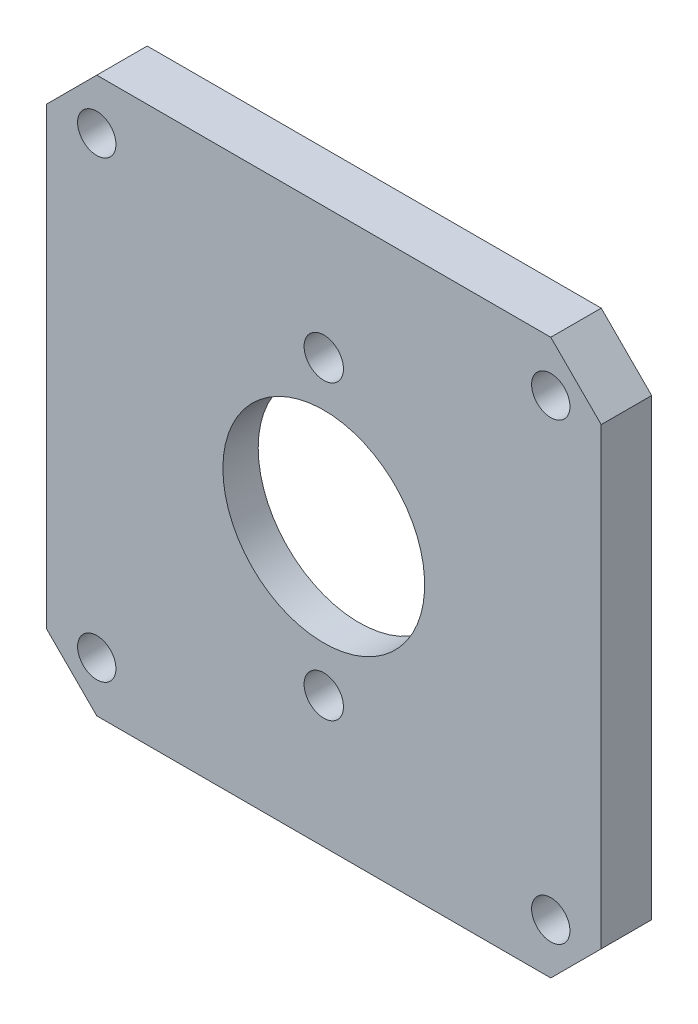
ISO-10303-21;
HEADER;
FILE_DESCRIPTION(('STEP AP214'),'2;1');
FILE_NAME('part.step','',(''),(''),'','','');
FILE_SCHEMA(('AUTOMOTIVE_DESIGN { 1 0 10303 214 1 1 1 1 }'));
ENDSEC;
DATA;
#1=APPLICATION_CONTEXT('core data for automotive mechanical design processes');
#2=APPLICATION_PROTOCOL_DEFINITION('international standard','automotive_design',2000,#1);
#3=PRODUCT_CONTEXT('',#1,'mechanical');
#4=PRODUCT('Part','Part','',(#3));
#5=PRODUCT_RELATED_PRODUCT_CATEGORY('part','',(#4));
#6=PRODUCT_DEFINITION_FORMATION('','',#4);
#7=PRODUCT_DEFINITION_CONTEXT('part definition',#1,'design');
#8=PRODUCT_DEFINITION('design','',#6,#7);
#9=PRODUCT_DEFINITION_SHAPE('','',#8);
#10=(LENGTH_UNIT() NAMED_UNIT(*) SI_UNIT(.MILLI.,.METRE.));
#11=(NAMED_UNIT(*) PLANE_ANGLE_UNIT() SI_UNIT($,.RADIAN.));
#12=(NAMED_UNIT(*) SI_UNIT($,.STERADIAN.) SOLID_ANGLE_UNIT());
#13=UNCERTAINTY_MEASURE_WITH_UNIT(LENGTH_MEASURE(1.E-05),#10,'distance_accuracy_value','');
#14=(GEOMETRIC_REPRESENTATION_CONTEXT(3) GLOBAL_UNCERTAINTY_ASSIGNED_CONTEXT((#13)) GLOBAL_UNIT_ASSIGNED_CONTEXT((#10,
#11,#12)) REPRESENTATION_CONTEXT('',''));
#15=CARTESIAN_POINT('',(0.,0.,0.));
#16=DIRECTION('',(0.,0.,1.));
#17=DIRECTION('',(1.,0.,0.));
#18=AXIS2_PLACEMENT_3D('',#15,#16,#17);
#19=CARTESIAN_POINT('',(0.,14.5,10.));
#20=DIRECTION('',(0.,0.,-1.));
#21=DIRECTION('',(-1.,0.,0.));
#22=AXIS2_PLACEMENT_3D('',#19,#20,#21);
#23=CYLINDRICAL_SURFACE('',#22,1.95);
#24=CARTESIAN_POINT('',(0.,14.5,5.));
#25=DIRECTION('',(0.,0.,-1.));
#26=DIRECTION('',(-1.,0.,0.));
#27=AXIS2_PLACEMENT_3D('',#24,#25,#26);
#28=CIRCLE('',#27,1.95);
#29=CARTESIAN_POINT('',(-1.95,14.5,5.));
#30=VERTEX_POINT('',#29);
#31=EDGE_CURVE('E389',#30,#30,#28,.T.);
#32=ORIENTED_EDGE('',*,*,#31,.F.);
#33=EDGE_LOOP('',(#32));
#34=FACE_BOUND('',#33,.T.);
#35=CARTESIAN_POINT('',(0.,14.5,1.5));
#36=DIRECTION('',(0.,0.,-1.));
#37=DIRECTION('',(-1.,0.,0.));
#38=AXIS2_PLACEMENT_3D('',#35,#36,#37);
#39=CIRCLE('',#38,1.95);
#40=CARTESIAN_POINT('',(-1.95,14.5,1.5));
#41=VERTEX_POINT('',#40);
#42=EDGE_CURVE('E376',#41,#41,#39,.F.);
#43=ORIENTED_EDGE('',*,*,#42,.F.);
#44=EDGE_LOOP('',(#43));
#45=FACE_BOUND('',#44,.T.);
#46=ADVANCED_FACE('F46',(#34,#45),#23,.F.);
#47=CARTESIAN_POINT('',(0.,0.,10.));
#48=DIRECTION('',(0.,0.,-1.));
#49=DIRECTION('',(-1.,0.,0.));
#50=AXIS2_PLACEMENT_3D('',#47,#48,#49);
#51=CYLINDRICAL_SURFACE('',#50,10.);
#52=CARTESIAN_POINT('',(0.,0.,5.));
#53=DIRECTION('',(0.,0.,-1.));
#54=DIRECTION('',(-1.,0.,0.));
#55=AXIS2_PLACEMENT_3D('',#52,#53,#54);
#56=CIRCLE('',#55,10.);
#57=CARTESIAN_POINT('',(-10.,0.,5.));
#58=VERTEX_POINT('',#57);
#59=EDGE_CURVE('E400',#58,#58,#56,.T.);
#60=ORIENTED_EDGE('',*,*,#59,.F.);
#61=EDGE_LOOP('',(#60));
#62=FACE_BOUND('',#61,.T.);
#63=CARTESIAN_POINT('',(0.,0.,1.5));
#64=DIRECTION('',(0.,0.,-1.));
#65=DIRECTION('',(-1.,0.,0.));
#66=AXIS2_PLACEMENT_3D('',#63,#64,#65);
#67=CIRCLE('',#66,10.);
#68=CARTESIAN_POINT('',(-10.,0.,1.5));
#69=VERTEX_POINT('',#68);
#70=EDGE_CURVE('E372',#69,#69,#67,.F.);
#71=ORIENTED_EDGE('',*,*,#70,.F.);
#72=EDGE_LOOP('',(#71));
#73=FACE_BOUND('',#72,.T.);
#74=ADVANCED_FACE('F222',(#62,#73),#51,.F.);
#75=CARTESIAN_POINT('',(0.,-14.5,10.));
#76=DIRECTION('',(0.,0.,-1.));
#77=DIRECTION('',(-1.,0.,0.));
#78=AXIS2_PLACEMENT_3D('',#75,#76,#77);
#79=CYLINDRICAL_SURFACE('',#78,1.95);
#80=CARTESIAN_POINT('',(0.,-14.5,5.));
#81=DIRECTION('',(0.,0.,-1.));
#82=DIRECTION('',(-1.,0.,0.));
#83=AXIS2_PLACEMENT_3D('',#80,#81,#82);
#84=CIRCLE('',#83,1.95);
#85=CARTESIAN_POINT('',(-1.95,-14.5,5.));
#86=VERTEX_POINT('',#85);
#87=EDGE_CURVE('E416',#86,#86,#84,.T.);
#88=ORIENTED_EDGE('',*,*,#87,.F.);
#89=EDGE_LOOP('',(#88));
#90=FACE_BOUND('',#89,.T.);
#91=CARTESIAN_POINT('',(0.,-14.5,1.5));
#92=DIRECTION('',(0.,0.,-1.));
#93=DIRECTION('',(-1.,0.,0.));
#94=AXIS2_PLACEMENT_3D('',#91,#92,#93);
#95=CIRCLE('',#94,1.95);
#96=CARTESIAN_POINT('',(-1.95,-14.5,1.5));
#97=VERTEX_POINT('',#96);
#98=EDGE_CURVE('E51',#97,#97,#95,.F.);
#99=ORIENTED_EDGE('',*,*,#98,.F.);
#100=EDGE_LOOP('',(#99));
#101=FACE_BOUND('',#100,.T.);
#102=ADVANCED_FACE('F214',(#90,#101),#79,.F.);
#103=CARTESIAN_POINT('',(-27.5,-27.5,5.));
#104=DIRECTION('',(-1.,0.,0.));
#105=DIRECTION('',(0.,0.,1.));
#106=AXIS2_PLACEMENT_3D('',#103,#104,#105);
#107=PLANE('',#106);
#108=DIRECTION('',(0.,1.,0.));
#109=VECTOR('',#108,1.);
#110=CARTESIAN_POINT('',(-27.5,-27.5,0.));
#111=LINE('',#110,#109);
#112=CARTESIAN_POINT('',(-27.5,-22.5,0.));
#113=VERTEX_POINT('',#112);
#114=CARTESIAN_POINT('',(-27.5,22.5,0.));
#115=VERTEX_POINT('',#114);
#116=EDGE_CURVE('E200',#113,#115,#111,.T.);
#117=ORIENTED_EDGE('',*,*,#116,.F.);
#118=DIRECTION('',(0.,0.,1.));
#119=VECTOR('',#118,1.);
#120=CARTESIAN_POINT('',(-27.5,-22.5,5.));
#121=LINE('',#120,#119);
#122=CARTESIAN_POINT('',(-27.5,-22.5,5.));
#123=VERTEX_POINT('',#122);
#124=EDGE_CURVE('E120',#113,#123,#121,.T.);
#125=ORIENTED_EDGE('',*,*,#124,.T.);
#126=DIRECTION('',(0.,1.,0.));
#127=VECTOR('',#126,1.);
#128=CARTESIAN_POINT('',(-27.5,-27.5,5.));
#129=LINE('',#128,#127);
#130=CARTESIAN_POINT('',(-27.5,22.5,5.));
#131=VERTEX_POINT('',#130);
#132=EDGE_CURVE('E144',#123,#131,#129,.T.);
#133=ORIENTED_EDGE('',*,*,#132,.T.);
#134=DIRECTION('',(0.,0.,-1.));
#135=VECTOR('',#134,1.);
#136=CARTESIAN_POINT('',(-27.5,22.5,5.));
#137=LINE('',#136,#135);
#138=EDGE_CURVE('E126',#131,#115,#137,.T.);
#139=ORIENTED_EDGE('',*,*,#138,.T.);
#140=EDGE_LOOP('',(#117,#125,#133,#139));
#141=FACE_BOUND('',#140,.T.);
#142=ADVANCED_FACE('F212',(#141),#107,.T.);
#143=CARTESIAN_POINT('',(-27.5,-27.5,5.));
#144=DIRECTION('',(0.,1.,0.));
#145=DIRECTION('',(0.,0.,1.));
#146=AXIS2_PLACEMENT_3D('',#143,#144,#145);
#147=PLANE('',#146);
#148=DIRECTION('',(1.,0.,0.));
#149=VECTOR('',#148,1.);
#150=CARTESIAN_POINT('',(-27.5,-27.5,5.));
#151=LINE('',#150,#149);
#152=CARTESIAN_POINT('',(-22.5,-27.5,5.));
#153=VERTEX_POINT('',#152);
#154=CARTESIAN_POINT('',(22.5,-27.5,5.));
#155=VERTEX_POINT('',#154);
#156=EDGE_CURVE('E136',#153,#155,#151,.T.);
#157=ORIENTED_EDGE('',*,*,#156,.F.);
#158=DIRECTION('',(0.,0.,-1.));
#159=VECTOR('',#158,1.);
#160=CARTESIAN_POINT('',(-22.5,-27.5,0.));
#161=LINE('',#160,#159);
#162=CARTESIAN_POINT('',(-22.5,-27.5,0.));
#163=VERTEX_POINT('',#162);
#164=EDGE_CURVE('E119',#153,#163,#161,.T.);
#165=ORIENTED_EDGE('',*,*,#164,.T.);
#166=DIRECTION('',(1.,0.,0.));
#167=VECTOR('',#166,1.);
#168=CARTESIAN_POINT('',(-27.5,-27.5,0.));
#169=LINE('',#168,#167);
#170=CARTESIAN_POINT('',(22.5,-27.5,0.));
#171=VERTEX_POINT('',#170);
#172=EDGE_CURVE('E133',#163,#171,#169,.T.);
#173=ORIENTED_EDGE('',*,*,#172,.T.);
#174=DIRECTION('',(0.,0.,1.));
#175=VECTOR('',#174,1.);
#176=CARTESIAN_POINT('',(22.5,-27.5,5.));
#177=LINE('',#176,#175);
#178=EDGE_CURVE('E139',#171,#155,#177,.T.);
#179=ORIENTED_EDGE('',*,*,#178,.T.);
#180=EDGE_LOOP('',(#157,#165,#173,#179));
#181=FACE_BOUND('',#180,.T.);
#182=ADVANCED_FACE('F132',(#181),#147,.F.);
#183=CARTESIAN_POINT('',(27.5,-27.5,5.));
#184=DIRECTION('',(-1.,0.,0.));
#185=DIRECTION('',(0.,0.,1.));
#186=AXIS2_PLACEMENT_3D('',#183,#184,#185);
#187=PLANE('',#186);
#188=DIRECTION('',(0.,1.,0.));
#189=VECTOR('',#188,1.);
#190=CARTESIAN_POINT('',(27.5,-27.5,5.));
#191=LINE('',#190,#189);
#192=CARTESIAN_POINT('',(27.5,-22.5,5.));
#193=VERTEX_POINT('',#192);
#194=CARTESIAN_POINT('',(27.5,22.5,5.));
#195=VERTEX_POINT('',#194);
#196=EDGE_CURVE('E192',#193,#195,#191,.T.);
#197=ORIENTED_EDGE('',*,*,#196,.F.);
#198=DIRECTION('',(0.,0.,-1.));
#199=VECTOR('',#198,1.);
#200=CARTESIAN_POINT('',(27.5,-22.5,5.));
#201=LINE('',#200,#199);
#202=CARTESIAN_POINT('',(27.5,-22.5,0.));
#203=VERTEX_POINT('',#202);
#204=EDGE_CURVE('E185',#193,#203,#201,.T.);
#205=ORIENTED_EDGE('',*,*,#204,.T.);
#206=DIRECTION('',(0.,1.,0.));
#207=VECTOR('',#206,1.);
#208=CARTESIAN_POINT('',(27.5,-27.5,0.));
#209=LINE('',#208,#207);
#210=CARTESIAN_POINT('',(27.5,22.5,0.));
#211=VERTEX_POINT('',#210);
#212=EDGE_CURVE('E145',#203,#211,#209,.T.);
#213=ORIENTED_EDGE('',*,*,#212,.T.);
#214=DIRECTION('',(0.,0.,1.));
#215=VECTOR('',#214,1.);
#216=CARTESIAN_POINT('',(27.5,22.5,5.));
#217=LINE('',#216,#215);
#218=EDGE_CURVE('E182',#211,#195,#217,.T.);
#219=ORIENTED_EDGE('',*,*,#218,.T.);
#220=EDGE_LOOP('',(#197,#205,#213,#219));
#221=FACE_BOUND('',#220,.T.);
#222=ADVANCED_FACE('F219',(#221),#187,.F.);
#223=CARTESIAN_POINT('',(-27.5,27.5,5.));
#224=DIRECTION('',(0.,1.,0.));
#225=DIRECTION('',(0.,0.,1.));
#226=AXIS2_PLACEMENT_3D('',#223,#224,#225);
#227=PLANE('',#226);
#228=DIRECTION('',(1.,0.,0.));
#229=VECTOR('',#228,1.);
#230=CARTESIAN_POINT('',(-27.5,27.5,5.));
#231=LINE('',#230,#229);
#232=CARTESIAN_POINT('',(-22.5,27.5,5.));
#233=VERTEX_POINT('',#232);
#234=CARTESIAN_POINT('',(22.5,27.5,5.));
#235=VERTEX_POINT('',#234);
#236=EDGE_CURVE('E150',#233,#235,#231,.T.);
#237=ORIENTED_EDGE('',*,*,#236,.T.);
#238=DIRECTION('',(0.,0.,-1.));
#239=VECTOR('',#238,1.);
#240=CARTESIAN_POINT('',(22.5,27.5,0.));
#241=LINE('',#240,#239);
#242=CARTESIAN_POINT('',(22.5,27.5,0.));
#243=VERTEX_POINT('',#242);
#244=EDGE_CURVE('E11',#235,#243,#241,.T.);
#245=ORIENTED_EDGE('',*,*,#244,.T.);
#246=DIRECTION('',(1.,0.,0.));
#247=VECTOR('',#246,1.);
#248=CARTESIAN_POINT('',(-27.5,27.5,0.));
#249=LINE('',#248,#247);
#250=CARTESIAN_POINT('',(-22.5,27.5,0.));
#251=VERTEX_POINT('',#250);
#252=EDGE_CURVE('E153',#251,#243,#249,.T.);
#253=ORIENTED_EDGE('',*,*,#252,.F.);
#254=DIRECTION('',(0.,0.,1.));
#255=VECTOR('',#254,1.);
#256=CARTESIAN_POINT('',(-22.5,27.5,5.));
#257=LINE('',#256,#255);
#258=EDGE_CURVE('E57',#251,#233,#257,.T.);
#259=ORIENTED_EDGE('',*,*,#258,.T.);
#260=EDGE_LOOP('',(#237,#245,#253,#259));
#261=FACE_BOUND('',#260,.T.);
#262=ADVANCED_FACE('F205',(#261),#227,.T.);
#263=CARTESIAN_POINT('',(0.,0.,5.));
#264=DIRECTION('',(0.,0.,-1.));
#265=DIRECTION('',(-1.,0.,0.));
#266=AXIS2_PLACEMENT_3D('',#263,#264,#265);
#267=PLANE('',#266);
#268=CARTESIAN_POINT('',(22.5,22.5,5.));
#269=DIRECTION('',(0.,0.,-1.));
#270=DIRECTION('',(-1.,0.,0.));
#271=AXIS2_PLACEMENT_3D('',#268,#269,#270);
#272=CIRCLE('',#271,1.9);
#273=CARTESIAN_POINT('',(20.6,22.5,5.));
#274=VERTEX_POINT('',#273);
#275=EDGE_CURVE('E202',#274,#274,#272,.T.);
#276=ORIENTED_EDGE('',*,*,#275,.T.);
#277=EDGE_LOOP('',(#276));
#278=FACE_BOUND('',#277,.T.);
#279=ORIENTED_EDGE('',*,*,#87,.T.);
#280=EDGE_LOOP('',(#279));
#281=FACE_BOUND('',#280,.T.);
#282=CARTESIAN_POINT('',(-22.5,22.5,5.));
#283=DIRECTION('',(0.,0.,-1.));
#284=DIRECTION('',(-1.,0.,0.));
#285=AXIS2_PLACEMENT_3D('',#282,#283,#284);
#286=CIRCLE('',#285,1.9);
#287=CARTESIAN_POINT('',(-24.4,22.5,5.));
#288=VERTEX_POINT('',#287);
#289=EDGE_CURVE('E412',#288,#288,#286,.T.);
#290=ORIENTED_EDGE('',*,*,#289,.T.);
#291=EDGE_LOOP('',(#290));
#292=FACE_BOUND('',#291,.T.);
#293=CARTESIAN_POINT('',(-22.5,-22.5,5.));
#294=DIRECTION('',(0.,0.,-1.));
#295=DIRECTION('',(-1.,0.,0.));
#296=AXIS2_PLACEMENT_3D('',#293,#294,#295);
#297=CIRCLE('',#296,1.9);
#298=CARTESIAN_POINT('',(-24.4,-22.5,5.));
#299=VERTEX_POINT('',#298);
#300=EDGE_CURVE('E408',#299,#299,#297,.T.);
#301=ORIENTED_EDGE('',*,*,#300,.T.);
#302=EDGE_LOOP('',(#301));
#303=FACE_BOUND('',#302,.T.);
#304=CARTESIAN_POINT('',(22.5,-22.5,5.));
#305=DIRECTION('',(0.,0.,-1.));
#306=DIRECTION('',(-1.,0.,0.));
#307=AXIS2_PLACEMENT_3D('',#304,#305,#306);
#308=CIRCLE('',#307,1.9);
#309=CARTESIAN_POINT('',(20.6,-22.5,5.));
#310=VERTEX_POINT('',#309);
#311=EDGE_CURVE('E404',#310,#310,#308,.T.);
#312=ORIENTED_EDGE('',*,*,#311,.T.);
#313=EDGE_LOOP('',(#312));
#314=FACE_BOUND('',#313,.T.);
#315=ORIENTED_EDGE('',*,*,#59,.T.);
#316=EDGE_LOOP('',(#315));
#317=FACE_BOUND('',#316,.T.);
#318=ORIENTED_EDGE('',*,*,#31,.T.);
#319=EDGE_LOOP('',(#318));
#320=FACE_BOUND('',#319,.T.);
#321=ORIENTED_EDGE('',*,*,#132,.F.);
#322=DIRECTION('',(0.707106781186546,-0.707106781186549,0.));
#323=VECTOR('',#322,1.);
#324=CARTESIAN_POINT('',(-22.5,-27.5,5.));
#325=LINE('',#324,#323);
#326=EDGE_CURVE('E179',#123,#153,#325,.T.);
#327=ORIENTED_EDGE('',*,*,#326,.T.);
#328=ORIENTED_EDGE('',*,*,#156,.T.);
#329=DIRECTION('',(-0.707106781186549,-0.707106781186546,0.));
#330=VECTOR('',#329,1.);
#331=CARTESIAN_POINT('',(27.5,-22.5,5.));
#332=LINE('',#331,#330);
#333=EDGE_CURVE('E176',#155,#193,#332,.F.);
#334=ORIENTED_EDGE('',*,*,#333,.T.);
#335=ORIENTED_EDGE('',*,*,#196,.T.);
#336=DIRECTION('',(-0.707106781186546,0.707106781186549,0.));
#337=VECTOR('',#336,1.);
#338=CARTESIAN_POINT('',(22.5,27.5,5.));
#339=LINE('',#338,#337);
#340=EDGE_CURVE('E64',#195,#235,#339,.T.);
#341=ORIENTED_EDGE('',*,*,#340,.T.);
#342=ORIENTED_EDGE('',*,*,#236,.F.);
#343=DIRECTION('',(0.707106781186549,0.707106781186546,0.));
#344=VECTOR('',#343,1.);
#345=CARTESIAN_POINT('',(-27.5,22.5,5.));
#346=LINE('',#345,#344);
#347=EDGE_CURVE('E171',#233,#131,#346,.F.);
#348=ORIENTED_EDGE('',*,*,#347,.T.);
#349=EDGE_LOOP('',(#321,#327,#328,#334,#335,#341,#342,#348));
#350=FACE_BOUND('',#349,.T.);
#351=ADVANCED_FACE('F210',(#278,#281,#292,#303,#314,#317,#320,#350),#267,.F.);
#352=CARTESIAN_POINT('',(0.,0.,0.));
#353=DIRECTION('',(0.,0.,-1.));
#354=DIRECTION('',(-1.,0.,0.));
#355=AXIS2_PLACEMENT_3D('',#352,#353,#354);
#356=PLANE('',#355);
#357=CARTESIAN_POINT('',(0.,0.,0.));
#358=DIRECTION('',(0.,0.,-1.));
#359=DIRECTION('',(-1.,0.,0.));
#360=AXIS2_PLACEMENT_3D('',#357,#358,#359);
#361=CIRCLE('',#360,17.5);
#362=CARTESIAN_POINT('',(-17.5,0.,0.));
#363=VERTEX_POINT('',#362);
#364=EDGE_CURVE('E366',#363,#363,#361,.T.);
#365=ORIENTED_EDGE('',*,*,#364,.F.);
#366=EDGE_LOOP('',(#365));
#367=FACE_BOUND('',#366,.T.);
#368=CARTESIAN_POINT('',(22.5,22.5,0.));
#369=DIRECTION('',(0.,0.,-1.));
#370=DIRECTION('',(-1.,0.,0.));
#371=AXIS2_PLACEMENT_3D('',#368,#369,#370);
#372=CIRCLE('',#371,1.9);
#373=CARTESIAN_POINT('',(20.6,22.5,0.));
#374=VERTEX_POINT('',#373);
#375=EDGE_CURVE('E385',#374,#374,#372,.T.);
#376=ORIENTED_EDGE('',*,*,#375,.F.);
#377=EDGE_LOOP('',(#376));
#378=FACE_BOUND('',#377,.T.);
#379=CARTESIAN_POINT('',(-22.5,22.5,0.));
#380=DIRECTION('',(0.,0.,-1.));
#381=DIRECTION('',(-1.,0.,0.));
#382=AXIS2_PLACEMENT_3D('',#379,#380,#381);
#383=CIRCLE('',#382,1.9);
#384=CARTESIAN_POINT('',(-24.4,22.5,0.));
#385=VERTEX_POINT('',#384);
#386=EDGE_CURVE('E390',#385,#385,#383,.T.);
#387=ORIENTED_EDGE('',*,*,#386,.F.);
#388=EDGE_LOOP('',(#387));
#389=FACE_BOUND('',#388,.T.);
#390=CARTESIAN_POINT('',(-22.5,-22.5,0.));
#391=DIRECTION('',(0.,0.,-1.));
#392=DIRECTION('',(-1.,0.,0.));
#393=AXIS2_PLACEMENT_3D('',#390,#391,#392);
#394=CIRCLE('',#393,1.9);
#395=CARTESIAN_POINT('',(-24.4,-22.5,0.));
#396=VERTEX_POINT('',#395);
#397=EDGE_CURVE('E384',#396,#396,#394,.T.);
#398=ORIENTED_EDGE('',*,*,#397,.F.);
#399=EDGE_LOOP('',(#398));
#400=FACE_BOUND('',#399,.T.);
#401=CARTESIAN_POINT('',(22.5,-22.5,0.));
#402=DIRECTION('',(0.,0.,-1.));
#403=DIRECTION('',(-1.,0.,0.));
#404=AXIS2_PLACEMENT_3D('',#401,#402,#403);
#405=CIRCLE('',#404,1.9);
#406=CARTESIAN_POINT('',(20.6,-22.5,0.));
#407=VERTEX_POINT('',#406);
#408=EDGE_CURVE('E380',#407,#407,#405,.T.);
#409=ORIENTED_EDGE('',*,*,#408,.F.);
#410=EDGE_LOOP('',(#409));
#411=FACE_BOUND('',#410,.T.);
#412=ORIENTED_EDGE('',*,*,#172,.F.);
#413=DIRECTION('',(-0.707106781186546,0.707106781186549,0.));
#414=VECTOR('',#413,1.);
#415=CARTESIAN_POINT('',(-25.0000000000001,-24.9999999999999,0.));
#416=LINE('',#415,#414);
#417=EDGE_CURVE('E115',#163,#113,#416,.T.);
#418=ORIENTED_EDGE('',*,*,#417,.T.);
#419=ORIENTED_EDGE('',*,*,#116,.T.);
#420=DIRECTION('',(-0.707106781186549,-0.707106781186546,0.));
#421=VECTOR('',#420,1.);
#422=CARTESIAN_POINT('',(-24.9999999999999,25.0000000000001,0.));
#423=LINE('',#422,#421);
#424=EDGE_CURVE('E138',#115,#251,#423,.F.);
#425=ORIENTED_EDGE('',*,*,#424,.T.);
#426=ORIENTED_EDGE('',*,*,#252,.T.);
#427=DIRECTION('',(0.707106781186546,-0.707106781186549,0.));
#428=VECTOR('',#427,1.);
#429=CARTESIAN_POINT('',(25.,24.9999999999999,0.));
#430=LINE('',#429,#428);
#431=EDGE_CURVE('E161',#243,#211,#430,.T.);
#432=ORIENTED_EDGE('',*,*,#431,.T.);
#433=ORIENTED_EDGE('',*,*,#212,.F.);
#434=DIRECTION('',(0.707106781186549,0.707106781186546,0.));
#435=VECTOR('',#434,1.);
#436=CARTESIAN_POINT('',(24.9999999999999,-25.,0.));
#437=LINE('',#436,#435);
#438=EDGE_CURVE('E127',#203,#171,#437,.F.);
#439=ORIENTED_EDGE('',*,*,#438,.T.);
#440=EDGE_LOOP('',(#412,#418,#419,#425,#426,#432,#433,#439));
#441=FACE_BOUND('',#440,.T.);
#442=ADVANCED_FACE('F141',(#367,#378,#389,#400,#411,#441),#356,.T.);
#443=CARTESIAN_POINT('',(-22.5,-27.5,5.));
#444=DIRECTION('',(-0.707106781186549,-0.707106781186546,0.));
#445=DIRECTION('',(0.,0.,1.));
#446=AXIS2_PLACEMENT_3D('',#443,#444,#445);
#447=PLANE('',#446);
#448=ORIENTED_EDGE('',*,*,#326,.F.);
#449=ORIENTED_EDGE('',*,*,#124,.F.);
#450=ORIENTED_EDGE('',*,*,#417,.F.);
#451=ORIENTED_EDGE('',*,*,#164,.F.);
#452=EDGE_LOOP('',(#448,#449,#450,#451));
#453=FACE_BOUND('',#452,.T.);
#454=ADVANCED_FACE('F118',(#453),#447,.T.);
#455=CARTESIAN_POINT('',(27.5,-22.5,5.));
#456=DIRECTION('',(-0.707106781186546,0.707106781186549,0.));
#457=DIRECTION('',(0.,0.,-1.));
#458=AXIS2_PLACEMENT_3D('',#455,#456,#457);
#459=PLANE('',#458);
#460=ORIENTED_EDGE('',*,*,#333,.F.);
#461=ORIENTED_EDGE('',*,*,#178,.F.);
#462=ORIENTED_EDGE('',*,*,#438,.F.);
#463=ORIENTED_EDGE('',*,*,#204,.F.);
#464=EDGE_LOOP('',(#460,#461,#462,#463));
#465=FACE_BOUND('',#464,.T.);
#466=ADVANCED_FACE('F263',(#465),#459,.F.);
#467=CARTESIAN_POINT('',(22.5,27.5,5.));
#468=DIRECTION('',(0.707106781186549,0.707106781186546,0.));
#469=DIRECTION('',(0.,0.,1.));
#470=AXIS2_PLACEMENT_3D('',#467,#468,#469);
#471=PLANE('',#470);
#472=ORIENTED_EDGE('',*,*,#340,.F.);
#473=ORIENTED_EDGE('',*,*,#218,.F.);
#474=ORIENTED_EDGE('',*,*,#431,.F.);
#475=ORIENTED_EDGE('',*,*,#244,.F.);
#476=EDGE_LOOP('',(#472,#473,#474,#475));
#477=FACE_BOUND('',#476,.T.);
#478=ADVANCED_FACE('F271',(#477),#471,.T.);
#479=CARTESIAN_POINT('',(-27.5,22.5,5.));
#480=DIRECTION('',(0.707106781186546,-0.707106781186549,0.));
#481=DIRECTION('',(0.,0.,-1.));
#482=AXIS2_PLACEMENT_3D('',#479,#480,#481);
#483=PLANE('',#482);
#484=ORIENTED_EDGE('',*,*,#347,.F.);
#485=ORIENTED_EDGE('',*,*,#258,.F.);
#486=ORIENTED_EDGE('',*,*,#424,.F.);
#487=ORIENTED_EDGE('',*,*,#138,.F.);
#488=EDGE_LOOP('',(#484,#485,#486,#487));
#489=FACE_BOUND('',#488,.T.);
#490=ADVANCED_FACE('F49',(#489),#483,.F.);
#491=CARTESIAN_POINT('',(22.5,-22.5,10.));
#492=DIRECTION('',(0.,0.,-1.));
#493=DIRECTION('',(-1.,0.,0.));
#494=AXIS2_PLACEMENT_3D('',#491,#492,#493);
#495=CYLINDRICAL_SURFACE('',#494,1.9);
#496=ORIENTED_EDGE('',*,*,#408,.T.);
#497=EDGE_LOOP('',(#496));
#498=FACE_BOUND('',#497,.T.);
#499=ORIENTED_EDGE('',*,*,#311,.F.);
#500=EDGE_LOOP('',(#499));
#501=FACE_BOUND('',#500,.T.);
#502=ADVANCED_FACE('F286',(#498,#501),#495,.F.);
#503=CARTESIAN_POINT('',(-22.5,-22.5,10.));
#504=DIRECTION('',(0.,0.,-1.));
#505=DIRECTION('',(-1.,0.,0.));
#506=AXIS2_PLACEMENT_3D('',#503,#504,#505);
#507=CYLINDRICAL_SURFACE('',#506,1.9);
#508=ORIENTED_EDGE('',*,*,#397,.T.);
#509=EDGE_LOOP('',(#508));
#510=FACE_BOUND('',#509,.T.);
#511=ORIENTED_EDGE('',*,*,#300,.F.);
#512=EDGE_LOOP('',(#511));
#513=FACE_BOUND('',#512,.T.);
#514=ADVANCED_FACE('F240',(#510,#513),#507,.F.);
#515=CARTESIAN_POINT('',(-22.5,22.5,10.));
#516=DIRECTION('',(0.,0.,-1.));
#517=DIRECTION('',(-1.,0.,0.));
#518=AXIS2_PLACEMENT_3D('',#515,#516,#517);
#519=CYLINDRICAL_SURFACE('',#518,1.9);
#520=ORIENTED_EDGE('',*,*,#386,.T.);
#521=EDGE_LOOP('',(#520));
#522=FACE_BOUND('',#521,.T.);
#523=ORIENTED_EDGE('',*,*,#289,.F.);
#524=EDGE_LOOP('',(#523));
#525=FACE_BOUND('',#524,.T.);
#526=ADVANCED_FACE('F306',(#522,#525),#519,.F.);
#527=CARTESIAN_POINT('',(22.5,22.5,10.));
#528=DIRECTION('',(0.,0.,-1.));
#529=DIRECTION('',(-1.,0.,0.));
#530=AXIS2_PLACEMENT_3D('',#527,#528,#529);
#531=CYLINDRICAL_SURFACE('',#530,1.9);
#532=ORIENTED_EDGE('',*,*,#375,.T.);
#533=EDGE_LOOP('',(#532));
#534=FACE_BOUND('',#533,.T.);
#535=ORIENTED_EDGE('',*,*,#275,.F.);
#536=EDGE_LOOP('',(#535));
#537=FACE_BOUND('',#536,.T.);
#538=ADVANCED_FACE('F313',(#534,#537),#531,.F.);
#539=CARTESIAN_POINT('',(0.,0.,1.5));
#540=DIRECTION('',(0.,0.,-1.));
#541=DIRECTION('',(-1.,0.,0.));
#542=AXIS2_PLACEMENT_3D('',#539,#540,#541);
#543=PLANE('',#542);
#544=CARTESIAN_POINT('',(0.,0.,1.5));
#545=DIRECTION('',(0.,0.,-1.));
#546=DIRECTION('',(-1.,0.,0.));
#547=AXIS2_PLACEMENT_3D('',#544,#545,#546);
#548=CIRCLE('',#547,17.5);
#549=CARTESIAN_POINT('',(-17.5,0.,1.5));
#550=VERTEX_POINT('',#549);
#551=EDGE_CURVE('E363',#550,#550,#548,.T.);
#552=ORIENTED_EDGE('',*,*,#551,.T.);
#553=EDGE_LOOP('',(#552));
#554=FACE_BOUND('',#553,.T.);
#555=ORIENTED_EDGE('',*,*,#98,.T.);
#556=EDGE_LOOP('',(#555));
#557=FACE_BOUND('',#556,.T.);
#558=ORIENTED_EDGE('',*,*,#70,.T.);
#559=EDGE_LOOP('',(#558));
#560=FACE_BOUND('',#559,.T.);
#561=ORIENTED_EDGE('',*,*,#42,.T.);
#562=EDGE_LOOP('',(#561));
#563=FACE_BOUND('',#562,.T.);
#564=ADVANCED_FACE('F320',(#554,#557,#560,#563),#543,.T.);
#565=CARTESIAN_POINT('',(0.,0.,1.5));
#566=DIRECTION('',(0.,0.,-1.));
#567=DIRECTION('',(-1.,0.,0.));
#568=AXIS2_PLACEMENT_3D('',#565,#566,#567);
#569=CYLINDRICAL_SURFACE('',#568,17.5);
#570=ORIENTED_EDGE('',*,*,#551,.F.);
#571=EDGE_LOOP('',(#570));
#572=FACE_BOUND('',#571,.T.);
#573=ORIENTED_EDGE('',*,*,#364,.T.);
#574=EDGE_LOOP('',(#573));
#575=FACE_BOUND('',#574,.T.);
#576=ADVANCED_FACE('F347',(#572,#575),#569,.F.);
#577=CLOSED_SHELL('',(#46,#74,#102,#142,#182,#222,#262,#351,#442,#454,#466,#478,#490,#502,#514,
#526,#538,#564,#576));
#578=MANIFOLD_SOLID_BREP('B2',#577);
#579=ADVANCED_BREP_SHAPE_REPRESENTATION('',(#18,#578),#14);
#580=SHAPE_DEFINITION_REPRESENTATION(#9,#579);
ENDSEC;
END-ISO-10303-21;
